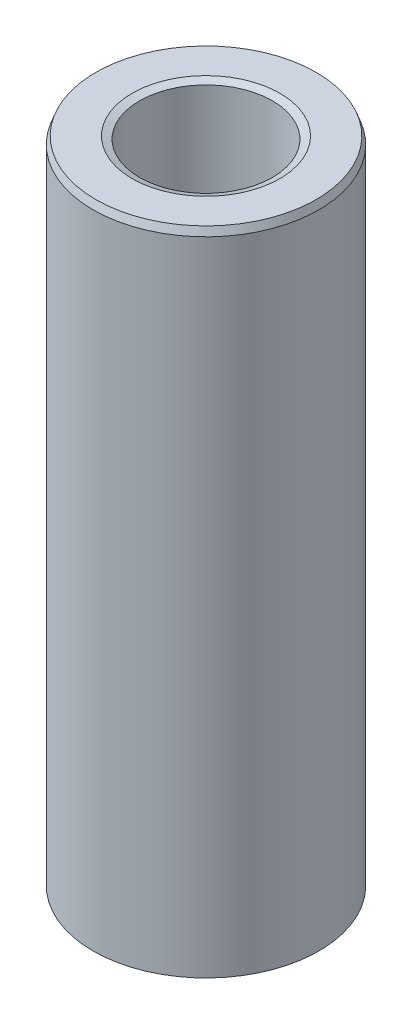
ISO-10303-21;
HEADER;
FILE_DESCRIPTION(('STEP AP214'),'2;1');
FILE_NAME('part.step','',(''),(''),'','','');
FILE_SCHEMA(('AUTOMOTIVE_DESIGN { 1 0 10303 214 1 1 1 1 }'));
ENDSEC;
DATA;
#1=APPLICATION_CONTEXT('core data for automotive mechanical design processes');
#2=APPLICATION_PROTOCOL_DEFINITION('international standard','automotive_design',2000,#1);
#3=PRODUCT_CONTEXT('',#1,'mechanical');
#4=PRODUCT('Part','Part','',(#3));
#5=PRODUCT_RELATED_PRODUCT_CATEGORY('part','',(#4));
#6=PRODUCT_DEFINITION_FORMATION('','',#4);
#7=PRODUCT_DEFINITION_CONTEXT('part definition',#1,'design');
#8=PRODUCT_DEFINITION('design','',#6,#7);
#9=PRODUCT_DEFINITION_SHAPE('','',#8);
#10=(LENGTH_UNIT() NAMED_UNIT(*) SI_UNIT(.MILLI.,.METRE.));
#11=(NAMED_UNIT(*) PLANE_ANGLE_UNIT() SI_UNIT($,.RADIAN.));
#12=(NAMED_UNIT(*) SI_UNIT($,.STERADIAN.) SOLID_ANGLE_UNIT());
#13=UNCERTAINTY_MEASURE_WITH_UNIT(LENGTH_MEASURE(1.E-05),#10,'distance_accuracy_value','');
#14=(GEOMETRIC_REPRESENTATION_CONTEXT(3) GLOBAL_UNCERTAINTY_ASSIGNED_CONTEXT((#13)) GLOBAL_UNIT_ASSIGNED_CONTEXT((#10,
#11,#12)) REPRESENTATION_CONTEXT('',''));
#15=CARTESIAN_POINT('',(0.,0.,0.));
#16=DIRECTION('',(0.,0.,1.));
#17=DIRECTION('',(1.,0.,0.));
#18=AXIS2_PLACEMENT_3D('',#15,#16,#17);
#19=CARTESIAN_POINT('',(0.,317.559864521997,0.));
#20=DIRECTION('',(0.,-1.,0.));
#21=DIRECTION('',(0.,0.,-1.));
#22=AXIS2_PLACEMENT_3D('',#19,#20,#21);
#23=CYLINDRICAL_SURFACE('',#22,55.);
#24=CARTESIAN_POINT('',(0.,1.33515040083099,0.));
#25=DIRECTION('',(0.,1.,0.));
#26=DIRECTION('',(0.,0.,1.));
#27=AXIS2_PLACEMENT_3D('',#24,#25,#26);
#28=CIRCLE('',#27,55.);
#29=CARTESIAN_POINT('',(0.,1.33515040083093,-55.));
#30=VERTEX_POINT('',#29);
#31=EDGE_CURVE('E10',#30,#30,#28,.T.);
#32=CARTESIAN_POINT('',(0.,313.906532335193,0.));
#33=DIRECTION('',(0.,1.,0.));
#34=DIRECTION('',(0.,0.,1.));
#35=AXIS2_PLACEMENT_3D('',#32,#33,#34);
#36=CIRCLE('',#35,55.);
#37=CARTESIAN_POINT('',(0.,313.906532335193,-55.));
#38=VERTEX_POINT('',#37);
#39=EDGE_CURVE('E50',#38,#38,#36,.F.);
#40=CARTESIAN_POINT('',(0.,1.33515040083093,-55.));
#41=CARTESIAN_POINT('',(0.,4.59110229598053,-55.));
#42=CARTESIAN_POINT('',(0.,7.84705419113013,-55.));
#43=CARTESIAN_POINT('',(0.,14.3589579814293,-55.));
#44=CARTESIAN_POINT('',(0.,17.6149098765789,-55.));
#45=CARTESIAN_POINT('',(0.,24.1268136668782,-55.));
#46=CARTESIAN_POINT('',(0.,27.3827655620278,-55.));
#47=CARTESIAN_POINT('',(0.,33.894669352327,-55.));
#48=CARTESIAN_POINT('',(0.,37.1506212474766,-55.));
#49=CARTESIAN_POINT('',(0.,43.6625250377758,-55.));
#50=CARTESIAN_POINT('',(0.,46.9184769329254,-55.));
#51=CARTESIAN_POINT('',(0.,53.4303807232246,-55.));
#52=CARTESIAN_POINT('',(0.,56.6863326183742,-55.));
#53=CARTESIAN_POINT('',(0.,63.1982364086734,-55.));
#54=CARTESIAN_POINT('',(0.,66.454188303823,-55.));
#55=CARTESIAN_POINT('',(0.,72.9660920941222,-55.));
#56=CARTESIAN_POINT('',(0.,76.2220439892718,-55.));
#57=CARTESIAN_POINT('',(0.,82.733947779571,-55.));
#58=CARTESIAN_POINT('',(0.,85.9898996747206,-55.));
#59=CARTESIAN_POINT('',(0.,92.5018034650198,-55.));
#60=CARTESIAN_POINT('',(0.,95.7577553601694,-55.));
#61=CARTESIAN_POINT('',(0.,102.269659150469,-55.));
#62=CARTESIAN_POINT('',(0.,105.525611045618,-55.));
#63=CARTESIAN_POINT('',(0.,112.037514835917,-55.));
#64=CARTESIAN_POINT('',(0.,115.293466731067,-55.));
#65=CARTESIAN_POINT('',(0.,121.805370521366,-55.));
#66=CARTESIAN_POINT('',(0.,125.061322416516,-55.));
#67=CARTESIAN_POINT('',(0.,131.573226206815,-55.));
#68=CARTESIAN_POINT('',(0.,134.829178101965,-55.));
#69=CARTESIAN_POINT('',(0.,141.341081892264,-55.));
#70=CARTESIAN_POINT('',(0.,144.597033787414,-55.));
#71=CARTESIAN_POINT('',(0.,151.108937577713,-55.));
#72=CARTESIAN_POINT('',(0.,154.364889472862,-55.));
#73=CARTESIAN_POINT('',(0.,160.876793263162,-55.));
#74=CARTESIAN_POINT('',(0.,164.132745158311,-55.));
#75=CARTESIAN_POINT('',(0.,170.64464894861,-55.));
#76=CARTESIAN_POINT('',(0.,173.90060084376,-55.));
#77=CARTESIAN_POINT('',(0.,180.412504634059,-55.));
#78=CARTESIAN_POINT('',(0.,183.668456529209,-55.));
#79=CARTESIAN_POINT('',(0.,190.180360319508,-55.));
#80=CARTESIAN_POINT('',(0.,193.436312214658,-55.));
#81=CARTESIAN_POINT('',(0.,199.948216004957,-55.));
#82=CARTESIAN_POINT('',(0.,203.204167900106,-55.));
#83=CARTESIAN_POINT('',(0.,209.716071690406,-55.));
#84=CARTESIAN_POINT('',(0.,212.972023585555,-55.));
#85=CARTESIAN_POINT('',(0.,219.483927375854,-55.));
#86=CARTESIAN_POINT('',(0.,222.739879271004,-55.));
#87=CARTESIAN_POINT('',(0.,229.251783061303,-55.));
#88=CARTESIAN_POINT('',(0.,232.507734956453,-55.));
#89=CARTESIAN_POINT('',(0.,239.019638746752,-55.));
#90=CARTESIAN_POINT('',(0.,242.275590641902,-55.));
#91=CARTESIAN_POINT('',(0.,248.787494432201,-55.));
#92=CARTESIAN_POINT('',(0.,252.04344632735,-55.));
#93=CARTESIAN_POINT('',(0.,258.55535011765,-55.));
#94=CARTESIAN_POINT('',(0.,261.811302012799,-55.));
#95=CARTESIAN_POINT('',(0.,268.323205803098,-55.));
#96=CARTESIAN_POINT('',(0.,271.579157698248,-55.));
#97=CARTESIAN_POINT('',(0.,278.091061488547,-55.));
#98=CARTESIAN_POINT('',(0.,281.347013383697,-55.));
#99=CARTESIAN_POINT('',(0.,287.858917173996,-55.));
#100=CARTESIAN_POINT('',(0.,291.114869069146,-55.));
#101=CARTESIAN_POINT('',(0.,297.626772859445,-55.));
#102=CARTESIAN_POINT('',(0.,300.882724754595,-55.));
#103=CARTESIAN_POINT('',(0.,307.394628544894,-55.));
#104=CARTESIAN_POINT('',(0.,310.650580440043,-55.));
#105=CARTESIAN_POINT('',(0.,313.906532335193,-55.));
#106=B_SPLINE_CURVE_WITH_KNOTS('',3,(#40,#41,#42,#43,#44,#45,#46,#47,#48,#49,#50,#51,#52,#53,
#54,#55,#56,#57,#58,#59,#60,#61,#62,#63,#64,#65,#66,#67,#68,#69,#70,#71,#72,#73,#74,#75,#76,#77,
#78,#79,#80,#81,#82,#83,#84,#85,#86,#87,#88,#89,#90,#91,#92,#93,#94,#95,#96,#97,#98,#99,#100,
#101,#102,#103,#104,#105),.UNSPECIFIED.,.F.,.F.,(4,2,2,2,2,2,2,2,2,2,2,2,2,2,2,2,2,2,2,2,2,2,2,
2,2,2,2,2,2,2,2,2,4),(0.,9.7678556854488,19.5357113708976,29.3035670563465,39.0714227417953,
48.8392784272441,58.6071341126929,68.3749897981417,78.1428454835905,87.9107011690393,
97.6785568544881,107.446412539937,117.214268225386,126.982123910835,136.749979596283,
146.517835281732,156.285690967181,166.05354665263,175.821402338079,185.589258023527,
195.357113708976,205.124969394425,214.892825079874,224.660680765323,234.428536450771,
244.19639213622,253.964247821669,263.732103507118,273.499959192567,283.267814878015,
293.035670563464,302.803526248913,312.571381934362),.UNSPECIFIED.);
#107=EDGE_CURVE('BSEAM39',#30,#38,#106,.T.);
#108=ORIENTED_EDGE('',*,*,#31,.T.);
#109=ORIENTED_EDGE('',*,*,#39,.T.);
#110=ORIENTED_EDGE('',*,*,#107,.T.);
#111=ORIENTED_EDGE('',*,*,#107,.F.);
#112=EDGE_LOOP('',(#108,#110,#109,#111));
#113=FACE_BOUND('',#112,.T.);
#114=ADVANCED_FACE('F39',(#113),#23,.T.);
#115=CARTESIAN_POINT('',(0.,317.559864521997,0.));
#116=DIRECTION('',(0.,1.,0.));
#117=DIRECTION('',(0.,0.,1.));
#118=AXIS2_PLACEMENT_3D('',#115,#116,#117);
#119=PLANE('',#118);
#120=CARTESIAN_POINT('',(0.,317.559864521997,0.));
#121=DIRECTION('',(0.,1.,0.));
#122=DIRECTION('',(0.,0.,1.));
#123=AXIS2_PLACEMENT_3D('',#120,#121,#122);
#124=CIRCLE('',#123,36.0032112894175);
#125=CARTESIAN_POINT('',(0.,317.559864521997,36.0032112894175));
#126=VERTEX_POINT('',#125);
#127=EDGE_CURVE('E58',#126,#126,#124,.F.);
#128=ORIENTED_EDGE('',*,*,#127,.T.);
#129=EDGE_LOOP('',(#128));
#130=FACE_BOUND('',#129,.T.);
#131=CARTESIAN_POINT('',(0.,317.559864521997,0.));
#132=DIRECTION('',(0.,1.,0.));
#133=DIRECTION('',(0.,0.,1.));
#134=AXIS2_PLACEMENT_3D('',#131,#132,#133);
#135=CIRCLE('',#134,53.6648495991693);
#136=CARTESIAN_POINT('',(0.,317.559864521997,53.6648495991693));
#137=VERTEX_POINT('',#136);
#138=EDGE_CURVE('E61',#137,#137,#135,.T.);
#139=ORIENTED_EDGE('',*,*,#138,.T.);
#140=EDGE_LOOP('',(#139));
#141=FACE_BOUND('',#140,.T.);
#142=ADVANCED_FACE('F88',(#130,#141),#119,.T.);
#143=CARTESIAN_POINT('',(0.,0.,0.));
#144=DIRECTION('',(0.,1.,0.));
#145=DIRECTION('',(0.,0.,1.));
#146=AXIS2_PLACEMENT_3D('',#143,#144,#145);
#147=PLANE('',#146);
#148=CARTESIAN_POINT('',(0.,0.,0.));
#149=DIRECTION('',(0.,1.,0.));
#150=DIRECTION('',(0.,0.,1.));
#151=AXIS2_PLACEMENT_3D('',#148,#149,#150);
#152=CIRCLE('',#151,33.6850295034441);
#153=CARTESIAN_POINT('',(0.,0.,33.6850295034441));
#154=VERTEX_POINT('',#153);
#155=EDGE_CURVE('E51',#154,#154,#152,.T.);
#156=ORIENTED_EDGE('',*,*,#155,.T.);
#157=EDGE_LOOP('',(#156));
#158=FACE_BOUND('',#157,.T.);
#159=CARTESIAN_POINT('',(0.,0.,0.));
#160=DIRECTION('',(0.,1.,0.));
#161=DIRECTION('',(0.,0.,1.));
#162=AXIS2_PLACEMENT_3D('',#159,#160,#161);
#163=CIRCLE('',#162,51.3466678131955);
#164=CARTESIAN_POINT('',(0.,0.,51.3466678131955));
#165=VERTEX_POINT('',#164);
#166=EDGE_CURVE('E54',#165,#165,#163,.F.);
#167=ORIENTED_EDGE('',*,*,#166,.T.);
#168=EDGE_LOOP('',(#167));
#169=FACE_BOUND('',#168,.T.);
#170=ADVANCED_FACE('F83',(#158,#169),#147,.F.);
#171=CARTESIAN_POINT('',(0.,317.559864521997,0.));
#172=DIRECTION('',(0.,-1.,0.));
#173=DIRECTION('',(0.,0.,-1.));
#174=AXIS2_PLACEMENT_3D('',#171,#172,#173);
#175=CYLINDRICAL_SURFACE('',#174,32.3498791026132);
#176=CARTESIAN_POINT('',(0.,316.224714121166,0.));
#177=DIRECTION('',(0.,1.,0.));
#178=DIRECTION('',(0.,0.,1.));
#179=AXIS2_PLACEMENT_3D('',#176,#177,#178);
#180=CIRCLE('',#179,32.3498791026132);
#181=CARTESIAN_POINT('',(0.,316.224714121166,-32.3498791026132));
#182=VERTEX_POINT('',#181);
#183=EDGE_CURVE('E67',#182,#182,#180,.T.);
#184=CARTESIAN_POINT('',(0.,3.65333218680419,0.));
#185=DIRECTION('',(0.,1.,0.));
#186=DIRECTION('',(0.,0.,1.));
#187=AXIS2_PLACEMENT_3D('',#184,#185,#186);
#188=CIRCLE('',#187,32.3498791026132);
#189=CARTESIAN_POINT('',(0.,3.65333218680414,-32.3498791026132));
#190=VERTEX_POINT('',#189);
#191=EDGE_CURVE('E69',#190,#190,#188,.F.);
#192=CARTESIAN_POINT('',(0.,316.224714121166,-32.3498791026132));
#193=CARTESIAN_POINT('',(0.,312.968762226016,-32.3498791026132));
#194=CARTESIAN_POINT('',(0.,309.712810330867,-32.3498791026132));
#195=CARTESIAN_POINT('',(0.,303.200906540567,-32.3498791026132));
#196=CARTESIAN_POINT('',(0.,299.944954645418,-32.3498791026132));
#197=CARTESIAN_POINT('',(0.,293.433050855119,-32.3498791026132));
#198=CARTESIAN_POINT('',(0.,290.177098959969,-32.3498791026132));
#199=CARTESIAN_POINT('',(0.,283.66519516967,-32.3498791026132));
#200=CARTESIAN_POINT('',(0.,280.40924327452,-32.3498791026132));
#201=CARTESIAN_POINT('',(0.,273.897339484221,-32.3498791026132));
#202=CARTESIAN_POINT('',(0.,270.641387589071,-32.3498791026132));
#203=CARTESIAN_POINT('',(0.,264.129483798772,-32.3498791026132));
#204=CARTESIAN_POINT('',(0.,260.873531903623,-32.3498791026132));
#205=CARTESIAN_POINT('',(0.,254.361628113323,-32.3498791026132));
#206=CARTESIAN_POINT('',(0.,251.105676218174,-32.3498791026132));
#207=CARTESIAN_POINT('',(0.,244.593772427875,-32.3498791026132));
#208=CARTESIAN_POINT('',(0.,241.337820532725,-32.3498791026132));
#209=CARTESIAN_POINT('',(0.,234.825916742426,-32.3498791026132));
#210=CARTESIAN_POINT('',(0.,231.569964847276,-32.3498791026132));
#211=CARTESIAN_POINT('',(0.,225.058061056977,-32.3498791026132));
#212=CARTESIAN_POINT('',(0.,221.802109161827,-32.3498791026132));
#213=CARTESIAN_POINT('',(0.,215.290205371528,-32.3498791026132));
#214=CARTESIAN_POINT('',(0.,212.034253476379,-32.3498791026132));
#215=CARTESIAN_POINT('',(0.,205.522349686079,-32.3498791026132));
#216=CARTESIAN_POINT('',(0.,202.26639779093,-32.3498791026132));
#217=CARTESIAN_POINT('',(0.,195.754494000631,-32.3498791026132));
#218=CARTESIAN_POINT('',(0.,192.498542105481,-32.3498791026132));
#219=CARTESIAN_POINT('',(0.,185.986638315182,-32.3498791026132));
#220=CARTESIAN_POINT('',(0.,182.730686420032,-32.3498791026132));
#221=CARTESIAN_POINT('',(0.,176.218782629733,-32.3498791026132));
#222=CARTESIAN_POINT('',(0.,172.962830734583,-32.3498791026132));
#223=CARTESIAN_POINT('',(0.,166.450926944284,-32.3498791026132));
#224=CARTESIAN_POINT('',(0.,163.194975049135,-32.3498791026132));
#225=CARTESIAN_POINT('',(0.,156.683071258835,-32.3498791026132));
#226=CARTESIAN_POINT('',(0.,153.427119363686,-32.3498791026132));
#227=CARTESIAN_POINT('',(0.,146.915215573387,-32.3498791026132));
#228=CARTESIAN_POINT('',(0.,143.659263678237,-32.3498791026132));
#229=CARTESIAN_POINT('',(0.,137.147359887938,-32.3498791026132));
#230=CARTESIAN_POINT('',(0.,133.891407992788,-32.3498791026132));
#231=CARTESIAN_POINT('',(0.,127.379504202489,-32.3498791026132));
#232=CARTESIAN_POINT('',(0.,124.123552307339,-32.3498791026132));
#233=CARTESIAN_POINT('',(0.,117.61164851704,-32.3498791026132));
#234=CARTESIAN_POINT('',(0.,114.355696621891,-32.3498791026132));
#235=CARTESIAN_POINT('',(0.,107.843792831591,-32.3498791026132));
#236=CARTESIAN_POINT('',(0.,104.587840936442,-32.3498791026132));
#237=CARTESIAN_POINT('',(0.,98.0759371461426,-32.3498791026132));
#238=CARTESIAN_POINT('',(0.,94.819985250993,-32.3498791026132));
#239=CARTESIAN_POINT('',(0.,88.3080814606938,-32.3498791026132));
#240=CARTESIAN_POINT('',(0.,85.0521295655442,-32.3498791026132));
#241=CARTESIAN_POINT('',(0.,78.540225775245,-32.3498791026132));
#242=CARTESIAN_POINT('',(0.,75.2842738800954,-32.3498791026132));
#243=CARTESIAN_POINT('',(0.,68.7723700897962,-32.3498791026132));
#244=CARTESIAN_POINT('',(0.,65.5164181946466,-32.3498791026132));
#245=CARTESIAN_POINT('',(0.,59.0045144043473,-32.3498791026132));
#246=CARTESIAN_POINT('',(0.,55.7485625091977,-32.3498791026132));
#247=CARTESIAN_POINT('',(0.,49.2366587188985,-32.3498791026132));
#248=CARTESIAN_POINT('',(0.,45.9807068237489,-32.3498791026132));
#249=CARTESIAN_POINT('',(0.,39.4688030334497,-32.3498791026132));
#250=CARTESIAN_POINT('',(0.,36.2128511383001,-32.3498791026132));
#251=CARTESIAN_POINT('',(0.,29.7009473480009,-32.3498791026132));
#252=CARTESIAN_POINT('',(0.,26.4449954528513,-32.3498791026132));
#253=CARTESIAN_POINT('',(0.,19.9330916625521,-32.3498791026132));
#254=CARTESIAN_POINT('',(0.,16.6771397674025,-32.3498791026132));
#255=CARTESIAN_POINT('',(0.,10.1652359771033,-32.3498791026132));
#256=CARTESIAN_POINT('',(0.,6.90928408195374,-32.3498791026132));
#257=CARTESIAN_POINT('',(0.,3.65333218680414,-32.3498791026132));
#258=B_SPLINE_CURVE_WITH_KNOTS('',3,(#192,#193,#194,#195,#196,#197,#198,#199,#200,#201,#202,
#203,#204,#205,#206,#207,#208,#209,#210,#211,#212,#213,#214,#215,#216,#217,#218,#219,#220,#221,
#222,#223,#224,#225,#226,#227,#228,#229,#230,#231,#232,#233,#234,#235,#236,#237,#238,#239,#240,
#241,#242,#243,#244,#245,#246,#247,#248,#249,#250,#251,#252,#253,#254,#255,#256,#257),
.UNSPECIFIED.,.F.,.F.,(4,2,2,2,2,2,2,2,2,2,2,2,2,2,2,2,2,2,2,2,2,2,2,2,2,2,2,2,2,2,2,2,4),(0.,
9.76785568544886,19.5357113708977,29.3035670563465,39.0714227417953,48.8392784272441,
58.6071341126929,68.3749897981417,78.1428454835905,87.9107011690393,97.6785568544881,
107.446412539937,117.214268225386,126.982123910834,136.749979596283,146.517835281732,
156.285690967181,166.05354665263,175.821402338078,185.589258023527,195.357113708976,
205.124969394425,214.892825079874,224.660680765322,234.428536450771,244.19639213622,
253.964247821669,263.732103507118,273.499959192567,283.267814878015,293.035670563464,
302.803526248913,312.571381934362),.UNSPECIFIED.);
#259=EDGE_CURVE('BSEAM71',#182,#190,#258,.T.);
#260=ORIENTED_EDGE('',*,*,#183,.T.);
#261=ORIENTED_EDGE('',*,*,#191,.T.);
#262=ORIENTED_EDGE('',*,*,#259,.T.);
#263=ORIENTED_EDGE('',*,*,#259,.F.);
#264=EDGE_LOOP('',(#260,#262,#261,#263));
#265=FACE_BOUND('',#264,.T.);
#266=ADVANCED_FACE('F71',(#265),#175,.F.);
#267=CARTESIAN_POINT('',(0.,316.224714121166,0.));
#268=DIRECTION('',(0.,1.,0.));
#269=DIRECTION('',(0.,0.,1.));
#270=AXIS2_PLACEMENT_3D('',#267,#268,#269);
#271=CONICAL_SURFACE('',#270,32.3498791026132,1.22041473637765);
#272=ORIENTED_EDGE('',*,*,#127,.F.);
#273=EDGE_LOOP('',(#272));
#274=FACE_BOUND('',#273,.T.);
#275=ORIENTED_EDGE('',*,*,#183,.F.);
#276=EDGE_LOOP('',(#275));
#277=FACE_BOUND('',#276,.T.);
#278=ADVANCED_FACE('F77',(#274,#277),#271,.F.);
#279=CARTESIAN_POINT('',(0.,0.,0.));
#280=DIRECTION('',(0.,-1.,0.));
#281=DIRECTION('',(0.,0.,-1.));
#282=AXIS2_PLACEMENT_3D('',#279,#280,#281);
#283=CONICAL_SURFACE('',#282,33.6850295034441,0.350381590417235);
#284=ORIENTED_EDGE('',*,*,#191,.F.);
#285=EDGE_LOOP('',(#284));
#286=FACE_BOUND('',#285,.T.);
#287=ORIENTED_EDGE('',*,*,#155,.F.);
#288=EDGE_LOOP('',(#287));
#289=FACE_BOUND('',#288,.T.);
#290=ADVANCED_FACE('F73',(#286,#289),#283,.F.);
#291=CARTESIAN_POINT('',(0.,1.33515040083099,0.));
#292=DIRECTION('',(0.,1.,0.));
#293=DIRECTION('',(0.,0.,1.));
#294=AXIS2_PLACEMENT_3D('',#291,#292,#293);
#295=CONICAL_SURFACE('',#294,55.,1.22041473637766);
#296=ORIENTED_EDGE('',*,*,#166,.F.);
#297=EDGE_LOOP('',(#296));
#298=FACE_BOUND('',#297,.T.);
#299=ORIENTED_EDGE('',*,*,#31,.F.);
#300=EDGE_LOOP('',(#299));
#301=FACE_BOUND('',#300,.T.);
#302=ADVANCED_FACE('F76',(#298,#301),#295,.T.);
#303=CARTESIAN_POINT('',(0.,317.559864521997,0.));
#304=DIRECTION('',(0.,-1.,0.));
#305=DIRECTION('',(0.,0.,-1.));
#306=AXIS2_PLACEMENT_3D('',#303,#304,#305);
#307=CONICAL_SURFACE('',#306,53.6648495991693,0.350381590417239);
#308=ORIENTED_EDGE('',*,*,#39,.F.);
#309=EDGE_LOOP('',(#308));
#310=FACE_BOUND('',#309,.T.);
#311=ORIENTED_EDGE('',*,*,#138,.F.);
#312=EDGE_LOOP('',(#311));
#313=FACE_BOUND('',#312,.T.);
#314=ADVANCED_FACE('F45',(#310,#313),#307,.T.);
#315=CLOSED_SHELL('',(#114,#142,#170,#266,#278,#290,#302,#314));
#316=MANIFOLD_SOLID_BREP('B2',#315);
#317=ADVANCED_BREP_SHAPE_REPRESENTATION('',(#18,#316),#14);
#318=SHAPE_DEFINITION_REPRESENTATION(#9,#317);
ENDSEC;
END-ISO-10303-21;
